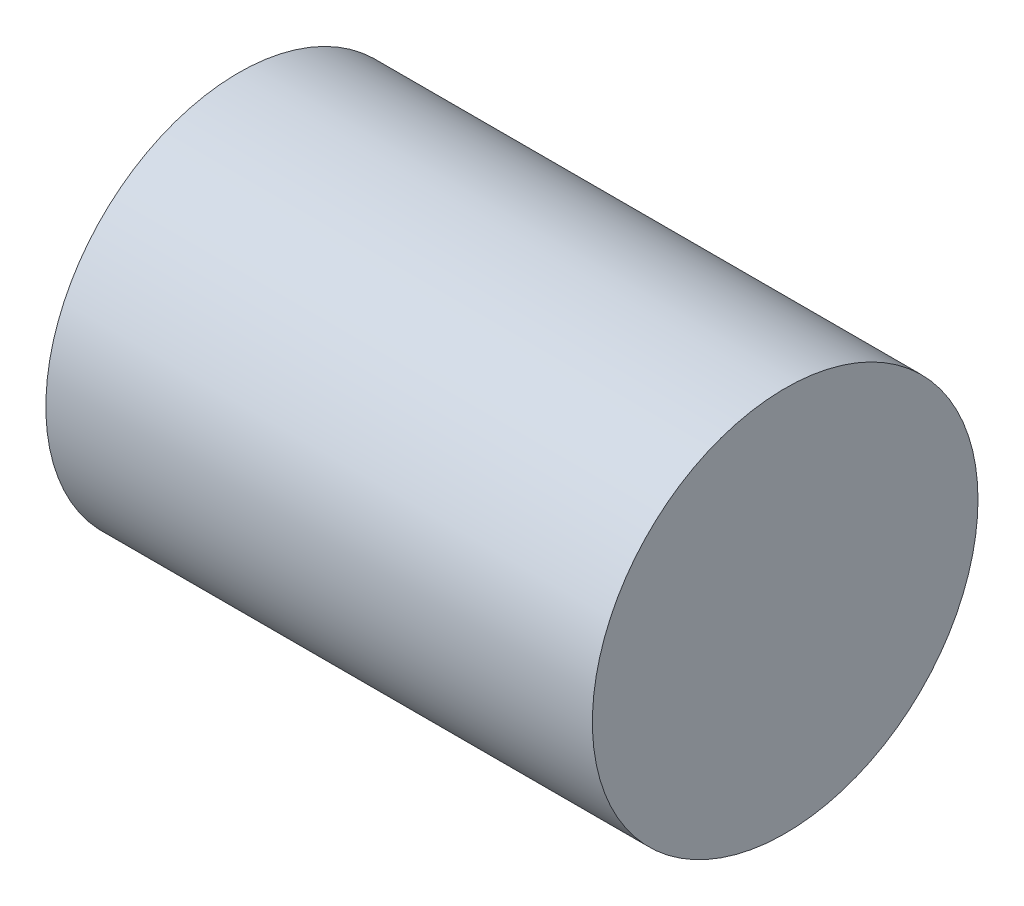
ISO-10303-21;
HEADER;
FILE_DESCRIPTION(('STEP AP214'),'2;1');
FILE_NAME('part.step','',(''),(''),'','','');
FILE_SCHEMA(('AUTOMOTIVE_DESIGN { 1 0 10303 214 1 1 1 1 }'));
ENDSEC;
DATA;
#1=APPLICATION_CONTEXT('core data for automotive mechanical design processes');
#2=APPLICATION_PROTOCOL_DEFINITION('international standard','automotive_design',2000,#1);
#3=PRODUCT_CONTEXT('',#1,'mechanical');
#4=PRODUCT('Part','Part','',(#3));
#5=PRODUCT_RELATED_PRODUCT_CATEGORY('part','',(#4));
#6=PRODUCT_DEFINITION_FORMATION('','',#4);
#7=PRODUCT_DEFINITION_CONTEXT('part definition',#1,'design');
#8=PRODUCT_DEFINITION('design','',#6,#7);
#9=PRODUCT_DEFINITION_SHAPE('','',#8);
#10=(LENGTH_UNIT() NAMED_UNIT(*) SI_UNIT(.MILLI.,.METRE.));
#11=(NAMED_UNIT(*) PLANE_ANGLE_UNIT() SI_UNIT($,.RADIAN.));
#12=(NAMED_UNIT(*) SI_UNIT($,.STERADIAN.) SOLID_ANGLE_UNIT());
#13=UNCERTAINTY_MEASURE_WITH_UNIT(LENGTH_MEASURE(1.E-05),#10,'distance_accuracy_value','');
#14=(GEOMETRIC_REPRESENTATION_CONTEXT(3) GLOBAL_UNCERTAINTY_ASSIGNED_CONTEXT((#13)) GLOBAL_UNIT_ASSIGNED_CONTEXT((#10,
#11,#12)) REPRESENTATION_CONTEXT('',''));
#15=CARTESIAN_POINT('',(0.,0.,0.));
#16=DIRECTION('',(0.,0.,1.));
#17=DIRECTION('',(1.,0.,0.));
#18=AXIS2_PLACEMENT_3D('',#15,#16,#17);
#19=CARTESIAN_POINT('',(2.25,0.,0.));
#20=DIRECTION('',(-1.,0.,0.));
#21=DIRECTION('',(0.,0.,1.));
#22=AXIS2_PLACEMENT_3D('',#19,#20,#21);
#23=CYLINDRICAL_SURFACE('',#22,1.5875);
#24=CARTESIAN_POINT('',(2.25,0.,0.));
#25=DIRECTION('',(1.,0.,0.));
#26=DIRECTION('',(0.,0.,-1.));
#27=AXIS2_PLACEMENT_3D('',#24,#25,#26);
#28=CIRCLE('',#27,1.5875);
#29=CARTESIAN_POINT('',(2.25,0.,-1.5875));
#30=VERTEX_POINT('',#29);
#31=EDGE_CURVE('E10',#30,#30,#28,.T.);
#32=ORIENTED_EDGE('',*,*,#31,.F.);
#33=EDGE_LOOP('',(#32));
#34=FACE_BOUND('',#33,.T.);
#35=CARTESIAN_POINT('',(-2.25,0.,0.));
#36=DIRECTION('',(1.,0.,0.));
#37=DIRECTION('',(0.,0.,-1.));
#38=AXIS2_PLACEMENT_3D('',#35,#36,#37);
#39=CIRCLE('',#38,1.5875);
#40=CARTESIAN_POINT('',(-2.25,0.,-1.5875));
#41=VERTEX_POINT('',#40);
#42=EDGE_CURVE('E34',#41,#41,#39,.T.);
#43=ORIENTED_EDGE('',*,*,#42,.T.);
#44=EDGE_LOOP('',(#43));
#45=FACE_BOUND('',#44,.T.);
#46=ADVANCED_FACE('F31',(#34,#45),#23,.T.);
#47=CARTESIAN_POINT('',(2.25,0.,0.));
#48=DIRECTION('',(1.,0.,0.));
#49=DIRECTION('',(0.,0.,-1.));
#50=AXIS2_PLACEMENT_3D('',#47,#48,#49);
#51=PLANE('',#50);
#52=ORIENTED_EDGE('',*,*,#31,.T.);
#53=EDGE_LOOP('',(#52));
#54=FACE_BOUND('',#53,.T.);
#55=ADVANCED_FACE('F46',(#54),#51,.T.);
#56=CARTESIAN_POINT('',(-2.25,0.,0.));
#57=DIRECTION('',(1.,0.,0.));
#58=DIRECTION('',(0.,0.,-1.));
#59=AXIS2_PLACEMENT_3D('',#56,#57,#58);
#60=PLANE('',#59);
#61=ORIENTED_EDGE('',*,*,#42,.F.);
#62=EDGE_LOOP('',(#61));
#63=FACE_BOUND('',#62,.T.);
#64=ADVANCED_FACE('F44',(#63),#60,.F.);
#65=CLOSED_SHELL('',(#46,#55,#64));
#66=MANIFOLD_SOLID_BREP('B2',#65);
#67=ADVANCED_BREP_SHAPE_REPRESENTATION('',(#18,#66),#14);
#68=SHAPE_DEFINITION_REPRESENTATION(#9,#67);
ENDSEC;
END-ISO-10303-21;
